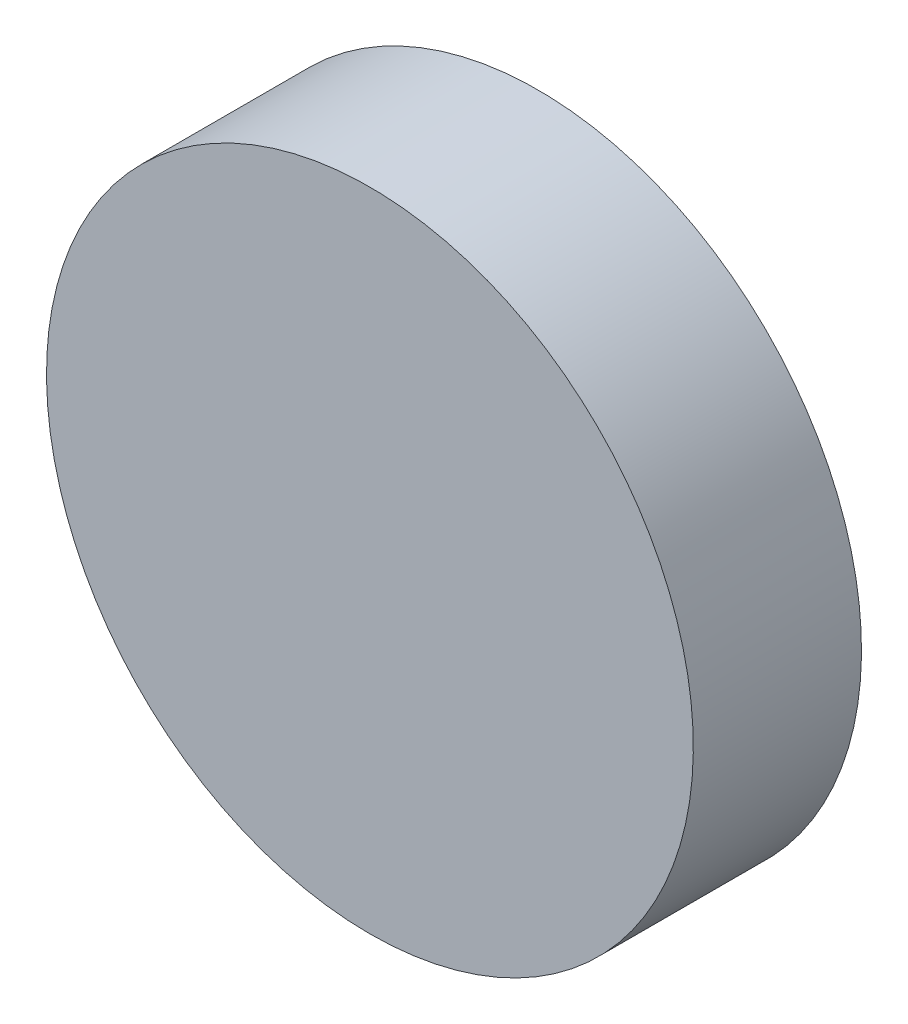
ISO-10303-21;
HEADER;
FILE_DESCRIPTION(('STEP AP214'),'2;1');
FILE_NAME('part.step','',(''),(''),'','','');
FILE_SCHEMA(('AUTOMOTIVE_DESIGN { 1 0 10303 214 1 1 1 1 }'));
ENDSEC;
DATA;
#1=APPLICATION_CONTEXT('core data for automotive mechanical design processes');
#2=APPLICATION_PROTOCOL_DEFINITION('international standard','automotive_design',2000,#1);
#3=PRODUCT_CONTEXT('',#1,'mechanical');
#4=PRODUCT('Part','Part','',(#3));
#5=PRODUCT_RELATED_PRODUCT_CATEGORY('part','',(#4));
#6=PRODUCT_DEFINITION_FORMATION('','',#4);
#7=PRODUCT_DEFINITION_CONTEXT('part definition',#1,'design');
#8=PRODUCT_DEFINITION('design','',#6,#7);
#9=PRODUCT_DEFINITION_SHAPE('','',#8);
#10=(LENGTH_UNIT() NAMED_UNIT(*) SI_UNIT(.MILLI.,.METRE.));
#11=(NAMED_UNIT(*) PLANE_ANGLE_UNIT() SI_UNIT($,.RADIAN.));
#12=(NAMED_UNIT(*) SI_UNIT($,.STERADIAN.) SOLID_ANGLE_UNIT());
#13=UNCERTAINTY_MEASURE_WITH_UNIT(LENGTH_MEASURE(1.E-05),#10,'distance_accuracy_value','');
#14=(GEOMETRIC_REPRESENTATION_CONTEXT(3) GLOBAL_UNCERTAINTY_ASSIGNED_CONTEXT((#13)) GLOBAL_UNIT_ASSIGNED_CONTEXT((#10,
#11,#12)) REPRESENTATION_CONTEXT('',''));
#15=CARTESIAN_POINT('',(0.,0.,0.));
#16=DIRECTION('',(0.,0.,1.));
#17=DIRECTION('',(1.,0.,0.));
#18=AXIS2_PLACEMENT_3D('',#15,#16,#17);
#19=CARTESIAN_POINT('',(0.,0.,10.));
#20=DIRECTION('',(0.,0.,-1.));
#21=DIRECTION('',(-1.,0.,0.));
#22=AXIS2_PLACEMENT_3D('',#19,#20,#21);
#23=CYLINDRICAL_SURFACE('',#22,25.);
#24=CARTESIAN_POINT('',(0.,0.,10.));
#25=DIRECTION('',(0.,0.,-1.));
#26=DIRECTION('',(0.,-1.,0.));
#27=AXIS2_PLACEMENT_3D('',#24,#25,#26);
#28=CIRCLE('',#27,25.);
#29=CARTESIAN_POINT('',(0.,-25.,10.));
#30=VERTEX_POINT('',#29);
#31=EDGE_CURVE('E10',#30,#30,#28,.T.);
#32=ORIENTED_EDGE('',*,*,#31,.T.);
#33=EDGE_LOOP('',(#32));
#34=FACE_BOUND('',#33,.T.);
#35=CARTESIAN_POINT('',(0.,0.,-3.));
#36=DIRECTION('',(0.,0.,-1.));
#37=DIRECTION('',(0.,-1.,0.));
#38=AXIS2_PLACEMENT_3D('',#35,#36,#37);
#39=CIRCLE('',#38,25.);
#40=CARTESIAN_POINT('',(0.,-25.,-3.));
#41=VERTEX_POINT('',#40);
#42=EDGE_CURVE('E18',#41,#41,#39,.T.);
#43=ORIENTED_EDGE('',*,*,#42,.F.);
#44=EDGE_LOOP('',(#43));
#45=FACE_BOUND('',#44,.T.);
#46=ADVANCED_FACE('F15',(#34,#45),#23,.T.);
#47=CARTESIAN_POINT('',(0.,0.,10.));
#48=DIRECTION('',(0.,0.,-1.));
#49=DIRECTION('',(-1.,0.,0.));
#50=AXIS2_PLACEMENT_3D('',#47,#48,#49);
#51=PLANE('',#50);
#52=ORIENTED_EDGE('',*,*,#31,.F.);
#53=EDGE_LOOP('',(#52));
#54=FACE_BOUND('',#53,.T.);
#55=ADVANCED_FACE('F30',(#54),#51,.F.);
#56=CARTESIAN_POINT('',(0.,0.,-3.));
#57=DIRECTION('',(0.,0.,-1.));
#58=DIRECTION('',(-1.,0.,0.));
#59=AXIS2_PLACEMENT_3D('',#56,#57,#58);
#60=PLANE('',#59);
#61=ORIENTED_EDGE('',*,*,#42,.T.);
#62=EDGE_LOOP('',(#61));
#63=FACE_BOUND('',#62,.T.);
#64=ADVANCED_FACE('F27',(#63),#60,.T.);
#65=CLOSED_SHELL('',(#46,#55,#64));
#66=MANIFOLD_SOLID_BREP('B1',#65);
#67=ADVANCED_BREP_SHAPE_REPRESENTATION('',(#18,#66),#14);
#68=SHAPE_DEFINITION_REPRESENTATION(#9,#67);
ENDSEC;
END-ISO-10303-21;
